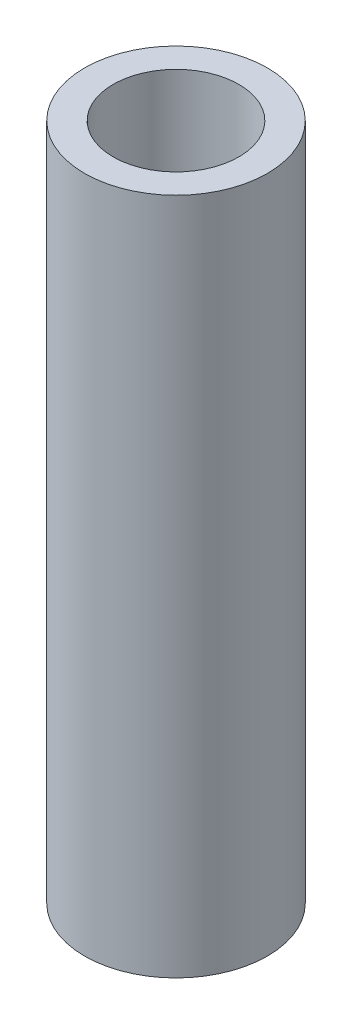
ISO-10303-21;
HEADER;
FILE_DESCRIPTION(('STEP AP214'),'2;1');
FILE_NAME('part.step','',(''),(''),'','','');
FILE_SCHEMA(('AUTOMOTIVE_DESIGN { 1 0 10303 214 1 1 1 1 }'));
ENDSEC;
DATA;
#1=APPLICATION_CONTEXT('core data for automotive mechanical design processes');
#2=APPLICATION_PROTOCOL_DEFINITION('international standard','automotive_design',2000,#1);
#3=PRODUCT_CONTEXT('',#1,'mechanical');
#4=PRODUCT('Part','Part','',(#3));
#5=PRODUCT_RELATED_PRODUCT_CATEGORY('part','',(#4));
#6=PRODUCT_DEFINITION_FORMATION('','',#4);
#7=PRODUCT_DEFINITION_CONTEXT('part definition',#1,'design');
#8=PRODUCT_DEFINITION('design','',#6,#7);
#9=PRODUCT_DEFINITION_SHAPE('','',#8);
#10=(LENGTH_UNIT() NAMED_UNIT(*) SI_UNIT(.MILLI.,.METRE.));
#11=(NAMED_UNIT(*) PLANE_ANGLE_UNIT() SI_UNIT($,.RADIAN.));
#12=(NAMED_UNIT(*) SI_UNIT($,.STERADIAN.) SOLID_ANGLE_UNIT());
#13=UNCERTAINTY_MEASURE_WITH_UNIT(LENGTH_MEASURE(1.E-05),#10,'distance_accuracy_value','');
#14=(GEOMETRIC_REPRESENTATION_CONTEXT(3) GLOBAL_UNCERTAINTY_ASSIGNED_CONTEXT((#13)) GLOBAL_UNIT_ASSIGNED_CONTEXT((#10,
#11,#12)) REPRESENTATION_CONTEXT('',''));
#15=CARTESIAN_POINT('',(0.,0.,0.));
#16=DIRECTION('',(0.,0.,1.));
#17=DIRECTION('',(1.,0.,0.));
#18=AXIS2_PLACEMENT_3D('',#15,#16,#17);
#19=CARTESIAN_POINT('',(0.,55.,0.));
#20=DIRECTION('',(0.,-1.,0.));
#21=DIRECTION('',(0.,0.,-1.));
#22=AXIS2_PLACEMENT_3D('',#19,#20,#21);
#23=CYLINDRICAL_SURFACE('',#22,7.4168);
#24=CARTESIAN_POINT('',(0.,55.,0.));
#25=DIRECTION('',(0.,1.,0.));
#26=DIRECTION('',(0.,0.,1.));
#27=AXIS2_PLACEMENT_3D('',#24,#25,#26);
#28=CIRCLE('',#27,7.4168);
#29=CARTESIAN_POINT('',(0.,55.,7.4168));
#30=VERTEX_POINT('',#29);
#31=EDGE_CURVE('E10',#30,#30,#28,.T.);
#32=ORIENTED_EDGE('',*,*,#31,.F.);
#33=EDGE_LOOP('',(#32));
#34=FACE_BOUND('',#33,.T.);
#35=CARTESIAN_POINT('',(0.,0.,0.));
#36=DIRECTION('',(0.,1.,0.));
#37=DIRECTION('',(0.,0.,1.));
#38=AXIS2_PLACEMENT_3D('',#35,#36,#37);
#39=CIRCLE('',#38,7.4168);
#40=CARTESIAN_POINT('',(0.,0.,7.4168));
#41=VERTEX_POINT('',#40);
#42=EDGE_CURVE('E49',#41,#41,#39,.T.);
#43=ORIENTED_EDGE('',*,*,#42,.T.);
#44=EDGE_LOOP('',(#43));
#45=FACE_BOUND('',#44,.T.);
#46=ADVANCED_FACE('F46',(#34,#45),#23,.T.);
#47=CARTESIAN_POINT('',(0.,55.,0.));
#48=DIRECTION('',(0.,1.,0.));
#49=DIRECTION('',(0.,0.,1.));
#50=AXIS2_PLACEMENT_3D('',#47,#48,#49);
#51=PLANE('',#50);
#52=CARTESIAN_POINT('',(0.,55.,0.));
#53=DIRECTION('',(0.,1.,0.));
#54=DIRECTION('',(0.,0.,1.));
#55=AXIS2_PLACEMENT_3D('',#52,#53,#54);
#56=CIRCLE('',#55,5.09999999999999);
#57=CARTESIAN_POINT('',(0.,55.,5.09999999999999));
#58=VERTEX_POINT('',#57);
#59=EDGE_CURVE('E64',#58,#58,#56,.T.);
#60=ORIENTED_EDGE('',*,*,#59,.F.);
#61=EDGE_LOOP('',(#60));
#62=FACE_BOUND('',#61,.T.);
#63=ORIENTED_EDGE('',*,*,#31,.T.);
#64=EDGE_LOOP('',(#63));
#65=FACE_BOUND('',#64,.T.);
#66=ADVANCED_FACE('F70',(#62,#65),#51,.T.);
#67=CARTESIAN_POINT('',(0.,0.,0.));
#68=DIRECTION('',(0.,1.,0.));
#69=DIRECTION('',(0.,0.,1.));
#70=AXIS2_PLACEMENT_3D('',#67,#68,#69);
#71=PLANE('',#70);
#72=CARTESIAN_POINT('',(0.,0.,0.));
#73=DIRECTION('',(0.,1.,0.));
#74=DIRECTION('',(0.,0.,1.));
#75=AXIS2_PLACEMENT_3D('',#72,#73,#74);
#76=CIRCLE('',#75,5.09999999999999);
#77=CARTESIAN_POINT('',(0.,0.,5.09999999999999));
#78=VERTEX_POINT('',#77);
#79=EDGE_CURVE('E59',#78,#78,#76,.T.);
#80=ORIENTED_EDGE('',*,*,#79,.T.);
#81=EDGE_LOOP('',(#80));
#82=FACE_BOUND('',#81,.T.);
#83=ORIENTED_EDGE('',*,*,#42,.F.);
#84=EDGE_LOOP('',(#83));
#85=FACE_BOUND('',#84,.T.);
#86=ADVANCED_FACE('F72',(#82,#85),#71,.F.);
#87=CARTESIAN_POINT('',(0.,55.,0.));
#88=DIRECTION('',(0.,1.,0.));
#89=DIRECTION('',(0.,0.,1.));
#90=AXIS2_PLACEMENT_3D('',#87,#88,#89);
#91=CYLINDRICAL_SURFACE('',#90,5.09999999999999);
#92=ORIENTED_EDGE('',*,*,#79,.F.);
#93=EDGE_LOOP('',(#92));
#94=FACE_BOUND('',#93,.T.);
#95=ORIENTED_EDGE('',*,*,#59,.T.);
#96=EDGE_LOOP('',(#95));
#97=FACE_BOUND('',#96,.T.);
#98=ADVANCED_FACE('F68',(#94,#97),#91,.F.);
#99=CLOSED_SHELL('',(#46,#66,#86,#98));
#100=MANIFOLD_SOLID_BREP('B2',#99);
#101=ADVANCED_BREP_SHAPE_REPRESENTATION('',(#18,#100),#14);
#102=SHAPE_DEFINITION_REPRESENTATION(#9,#101);
ENDSEC;
END-ISO-10303-21;
